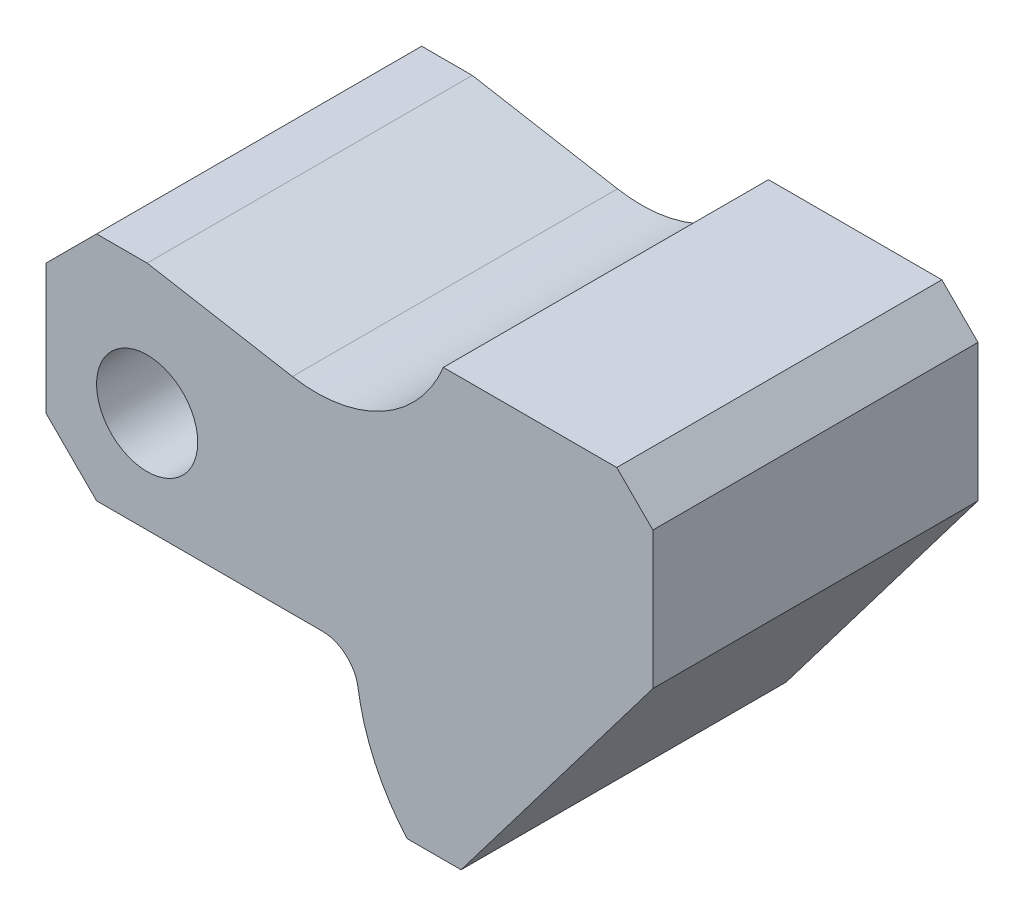
ISO-10303-21;
HEADER;
FILE_DESCRIPTION(('STEP AP214'),'2;1');
FILE_NAME('part.step','',(''),(''),'','','');
FILE_SCHEMA(('AUTOMOTIVE_DESIGN { 1 0 10303 214 1 1 1 1 }'));
ENDSEC;
DATA;
#1=APPLICATION_CONTEXT('core data for automotive mechanical design processes');
#2=APPLICATION_PROTOCOL_DEFINITION('international standard','automotive_design',2000,#1);
#3=PRODUCT_CONTEXT('',#1,'mechanical');
#4=PRODUCT('Part','Part','',(#3));
#5=PRODUCT_RELATED_PRODUCT_CATEGORY('part','',(#4));
#6=PRODUCT_DEFINITION_FORMATION('','',#4);
#7=PRODUCT_DEFINITION_CONTEXT('part definition',#1,'design');
#8=PRODUCT_DEFINITION('design','',#6,#7);
#9=PRODUCT_DEFINITION_SHAPE('','',#8);
#10=(LENGTH_UNIT() NAMED_UNIT(*) SI_UNIT(.MILLI.,.METRE.));
#11=(NAMED_UNIT(*) PLANE_ANGLE_UNIT() SI_UNIT($,.RADIAN.));
#12=(NAMED_UNIT(*) SI_UNIT($,.STERADIAN.) SOLID_ANGLE_UNIT());
#13=UNCERTAINTY_MEASURE_WITH_UNIT(LENGTH_MEASURE(1.E-05),#10,'distance_accuracy_value','');
#14=(GEOMETRIC_REPRESENTATION_CONTEXT(3) GLOBAL_UNCERTAINTY_ASSIGNED_CONTEXT((#13)) GLOBAL_UNIT_ASSIGNED_CONTEXT((#10,
#11,#12)) REPRESENTATION_CONTEXT('',''));
#15=CARTESIAN_POINT('',(0.,0.,0.));
#16=DIRECTION('',(0.,0.,1.));
#17=DIRECTION('',(1.,0.,0.));
#18=AXIS2_PLACEMENT_3D('',#15,#16,#17);
#19=CARTESIAN_POINT('',(61.0250562805475,-46.2889962459451,45.));
#20=DIRECTION('',(0.796728196361411,-0.60433780381728,0.));
#21=DIRECTION('',(0.60433780381728,0.796728196361411,0.));
#22=AXIS2_PLACEMENT_3D('',#19,#20,#21);
#23=PLANE('',#22);
#24=DIRECTION('',(-0.60433780381728,-0.796728196361411,0.));
#25=VECTOR('',#24,1.);
#26=CARTESIAN_POINT('',(61.0250562805475,-46.2889962459451,0.));
#27=LINE('',#26,#25);
#28=CARTESIAN_POINT('',(84.,-16.,0.));
#29=VERTEX_POINT('',#28);
#30=CARTESIAN_POINT('',(57.4516448266757,-51.,0.));
#31=VERTEX_POINT('',#30);
#32=EDGE_CURVE('E175',#29,#31,#27,.T.);
#33=ORIENTED_EDGE('',*,*,#32,.F.);
#34=DIRECTION('',(0.,0.,-1.));
#35=VECTOR('',#34,1.);
#36=CARTESIAN_POINT('',(84.,-16.,45.));
#37=LINE('',#36,#35);
#38=CARTESIAN_POINT('',(84.,-16.,45.));
#39=VERTEX_POINT('',#38);
#40=EDGE_CURVE('E161',#39,#29,#37,.T.);
#41=ORIENTED_EDGE('',*,*,#40,.F.);
#42=DIRECTION('',(-0.60433780381728,-0.796728196361411,0.));
#43=VECTOR('',#42,1.);
#44=CARTESIAN_POINT('',(61.0250562805475,-46.2889962459451,45.));
#45=LINE('',#44,#43);
#46=CARTESIAN_POINT('',(57.4516448266757,-51.,45.));
#47=VERTEX_POINT('',#46);
#48=EDGE_CURVE('E170',#39,#47,#45,.T.);
#49=ORIENTED_EDGE('',*,*,#48,.T.);
#50=DIRECTION('',(0.,0.,-1.));
#51=VECTOR('',#50,1.);
#52=CARTESIAN_POINT('',(57.4516448266757,-51.,45.));
#53=LINE('',#52,#51);
#54=EDGE_CURVE('E218',#47,#31,#53,.T.);
#55=ORIENTED_EDGE('',*,*,#54,.T.);
#56=EDGE_LOOP('',(#33,#41,#49,#55));
#57=FACE_BOUND('',#56,.T.);
#58=ADVANCED_FACE('F55',(#57),#23,.T.);
#59=CARTESIAN_POINT('',(84.,0.,45.));
#60=DIRECTION('',(1.,0.,0.));
#61=DIRECTION('',(0.,1.,0.));
#62=AXIS2_PLACEMENT_3D('',#59,#60,#61);
#63=PLANE('',#62);
#64=DIRECTION('',(0.,-1.,0.));
#65=VECTOR('',#64,1.);
#66=CARTESIAN_POINT('',(84.,0.,0.));
#67=LINE('',#66,#65);
#68=CARTESIAN_POINT('',(84.,3.,0.));
#69=VERTEX_POINT('',#68);
#70=EDGE_CURVE('E225',#69,#29,#67,.T.);
#71=ORIENTED_EDGE('',*,*,#70,.F.);
#72=DIRECTION('',(0.,0.,1.));
#73=VECTOR('',#72,1.);
#74=CARTESIAN_POINT('',(84.,3.,45.));
#75=LINE('',#74,#73);
#76=CARTESIAN_POINT('',(84.,3.,45.));
#77=VERTEX_POINT('',#76);
#78=EDGE_CURVE('E164',#69,#77,#75,.T.);
#79=ORIENTED_EDGE('',*,*,#78,.T.);
#80=DIRECTION('',(0.,-1.,0.));
#81=VECTOR('',#80,1.);
#82=CARTESIAN_POINT('',(84.,0.,45.));
#83=LINE('',#82,#81);
#84=EDGE_CURVE('E157',#77,#39,#83,.T.);
#85=ORIENTED_EDGE('',*,*,#84,.T.);
#86=ORIENTED_EDGE('',*,*,#40,.T.);
#87=EDGE_LOOP('',(#71,#79,#85,#86));
#88=FACE_BOUND('',#87,.T.);
#89=ADVANCED_FACE('F160',(#88),#63,.T.);
#90=CARTESIAN_POINT('',(0.,8.,45.));
#91=DIRECTION('',(0.,1.,0.));
#92=DIRECTION('',(0.,0.,1.));
#93=AXIS2_PLACEMENT_3D('',#90,#91,#92);
#94=PLANE('',#93);
#95=DIRECTION('',(1.,0.,0.));
#96=VECTOR('',#95,1.);
#97=CARTESIAN_POINT('',(0.,8.,45.));
#98=LINE('',#97,#96);
#99=CARTESIAN_POINT('',(55.,8.,45.));
#100=VERTEX_POINT('',#99);
#101=CARTESIAN_POINT('',(79.,8.,45.));
#102=VERTEX_POINT('',#101);
#103=EDGE_CURVE('E169',#100,#102,#98,.T.);
#104=ORIENTED_EDGE('',*,*,#103,.T.);
#105=DIRECTION('',(0.,0.,-1.));
#106=VECTOR('',#105,1.);
#107=CARTESIAN_POINT('',(79.,8.,45.));
#108=LINE('',#107,#106);
#109=CARTESIAN_POINT('',(79.,8.,0.));
#110=VERTEX_POINT('',#109);
#111=EDGE_CURVE('E296',#102,#110,#108,.T.);
#112=ORIENTED_EDGE('',*,*,#111,.T.);
#113=DIRECTION('',(1.,0.,0.));
#114=VECTOR('',#113,1.);
#115=CARTESIAN_POINT('',(0.,8.,0.));
#116=LINE('',#115,#114);
#117=CARTESIAN_POINT('',(55.,8.,0.));
#118=VERTEX_POINT('',#117);
#119=EDGE_CURVE('E228',#118,#110,#116,.T.);
#120=ORIENTED_EDGE('',*,*,#119,.F.);
#121=DIRECTION('',(0.,0.,-1.));
#122=VECTOR('',#121,1.);
#123=CARTESIAN_POINT('',(55.,8.,45.));
#124=LINE('',#123,#122);
#125=EDGE_CURVE('E178',#100,#118,#124,.T.);
#126=ORIENTED_EDGE('',*,*,#125,.F.);
#127=EDGE_LOOP('',(#104,#112,#120,#126));
#128=FACE_BOUND('',#127,.T.);
#129=ADVANCED_FACE('F343',(#128),#94,.T.);
#130=CARTESIAN_POINT('',(37.4033577276849,15.1664622192663,45.));
#131=DIRECTION('',(0.,0.,-1.));
#132=DIRECTION('',(-1.,0.,0.));
#133=AXIS2_PLACEMENT_3D('',#130,#131,#132);
#134=CYLINDRICAL_SURFACE('',#133,19.);
#135=CARTESIAN_POINT('',(37.4033577276849,15.1664622192663,0.));
#136=DIRECTION('',(0.,0.,1.));
#137=DIRECTION('',(1.,0.,0.));
#138=AXIS2_PLACEMENT_3D('',#135,#136,#137);
#139=CIRCLE('',#138,19.);
#140=CARTESIAN_POINT('',(34.1040423520132,-3.54488508796561,0.));
#141=VERTEX_POINT('',#140);
#142=EDGE_CURVE('E232',#141,#118,#139,.T.);
#143=ORIENTED_EDGE('',*,*,#142,.F.);
#144=DIRECTION('',(0.,0.,-1.));
#145=VECTOR('',#144,1.);
#146=CARTESIAN_POINT('',(34.1040423520132,-3.54488508796561,45.));
#147=LINE('',#146,#145);
#148=CARTESIAN_POINT('',(34.1040423520132,-3.54488508796561,45.));
#149=VERTEX_POINT('',#148);
#150=EDGE_CURVE('E266',#149,#141,#147,.T.);
#151=ORIENTED_EDGE('',*,*,#150,.F.);
#152=CARTESIAN_POINT('',(37.4033577276849,15.1664622192663,45.));
#153=DIRECTION('',(0.,0.,1.));
#154=DIRECTION('',(1.,0.,0.));
#155=AXIS2_PLACEMENT_3D('',#152,#153,#154);
#156=CIRCLE('',#155,19.);
#157=EDGE_CURVE('E195',#149,#100,#156,.T.);
#158=ORIENTED_EDGE('',*,*,#157,.T.);
#159=ORIENTED_EDGE('',*,*,#125,.T.);
#160=EDGE_LOOP('',(#143,#151,#158,#159));
#161=FACE_BOUND('',#160,.T.);
#162=ADVANCED_FACE('F376',(#161),#134,.F.);
#163=CARTESIAN_POINT('',(0.422151654498645,2.39414100327969,45.));
#164=DIRECTION('',(0.173648177666931,0.984807753012208,0.));
#165=DIRECTION('',(-0.984807753012208,0.173648177666931,0.));
#166=AXIS2_PLACEMENT_3D('',#163,#164,#165);
#167=PLANE('',#166);
#168=DIRECTION('',(0.984807753012208,-0.173648177666931,0.));
#169=VECTOR('',#168,1.);
#170=CARTESIAN_POINT('',(0.422151654498645,2.39414100327969,0.));
#171=LINE('',#170,#169);
#172=CARTESIAN_POINT('',(14.,0.,0.));
#173=VERTEX_POINT('',#172);
#174=EDGE_CURVE('E236',#173,#141,#171,.T.);
#175=ORIENTED_EDGE('',*,*,#174,.F.);
#176=DIRECTION('',(0.,0.,-1.));
#177=VECTOR('',#176,1.);
#178=CARTESIAN_POINT('',(14.,0.,45.));
#179=LINE('',#178,#177);
#180=CARTESIAN_POINT('',(14.,0.,45.));
#181=VERTEX_POINT('',#180);
#182=EDGE_CURVE('E262',#181,#173,#179,.T.);
#183=ORIENTED_EDGE('',*,*,#182,.F.);
#184=DIRECTION('',(0.984807753012208,-0.173648177666931,0.));
#185=VECTOR('',#184,1.);
#186=CARTESIAN_POINT('',(0.422151654498645,2.39414100327969,45.));
#187=LINE('',#186,#185);
#188=EDGE_CURVE('E199',#181,#149,#187,.T.);
#189=ORIENTED_EDGE('',*,*,#188,.T.);
#190=ORIENTED_EDGE('',*,*,#150,.T.);
#191=EDGE_LOOP('',(#175,#183,#189,#190));
#192=FACE_BOUND('',#191,.T.);
#193=ADVANCED_FACE('F382',(#192),#167,.T.);
#194=CARTESIAN_POINT('',(0.,0.,45.));
#195=DIRECTION('',(0.,1.,0.));
#196=DIRECTION('',(0.,0.,1.));
#197=AXIS2_PLACEMENT_3D('',#194,#195,#196);
#198=PLANE('',#197);
#199=DIRECTION('',(1.,0.,0.));
#200=VECTOR('',#199,1.);
#201=CARTESIAN_POINT('',(0.,0.,0.));
#202=LINE('',#201,#200);
#203=CARTESIAN_POINT('',(7.00000000000003,0.,0.));
#204=VERTEX_POINT('',#203);
#205=EDGE_CURVE('E240',#204,#173,#202,.T.);
#206=ORIENTED_EDGE('',*,*,#205,.F.);
#207=DIRECTION('',(0.,0.,1.));
#208=VECTOR('',#207,1.);
#209=CARTESIAN_POINT('',(7.00000000000003,0.,45.));
#210=LINE('',#209,#208);
#211=CARTESIAN_POINT('',(7.00000000000003,0.,45.));
#212=VERTEX_POINT('',#211);
#213=EDGE_CURVE('E277',#204,#212,#210,.T.);
#214=ORIENTED_EDGE('',*,*,#213,.T.);
#215=DIRECTION('',(1.,0.,0.));
#216=VECTOR('',#215,1.);
#217=CARTESIAN_POINT('',(0.,0.,45.));
#218=LINE('',#217,#216);
#219=EDGE_CURVE('E203',#212,#181,#218,.T.);
#220=ORIENTED_EDGE('',*,*,#219,.T.);
#221=ORIENTED_EDGE('',*,*,#182,.T.);
#222=EDGE_LOOP('',(#206,#214,#220,#221));
#223=FACE_BOUND('',#222,.T.);
#224=ADVANCED_FACE('F385',(#223),#198,.T.);
#225=CARTESIAN_POINT('',(0.,0.,45.));
#226=DIRECTION('',(1.,0.,0.));
#227=DIRECTION('',(0.,0.,-1.));
#228=AXIS2_PLACEMENT_3D('',#225,#226,#227);
#229=PLANE('',#228);
#230=DIRECTION('',(0.,-1.,0.));
#231=VECTOR('',#230,1.);
#232=CARTESIAN_POINT('',(0.,0.,0.));
#233=LINE('',#232,#231);
#234=CARTESIAN_POINT('',(0.,-7.,0.));
#235=VERTEX_POINT('',#234);
#236=CARTESIAN_POINT('',(0.,-25.,0.));
#237=VERTEX_POINT('',#236);
#238=EDGE_CURVE('E243',#235,#237,#233,.T.);
#239=ORIENTED_EDGE('',*,*,#238,.T.);
#240=DIRECTION('',(0.,0.,1.));
#241=VECTOR('',#240,1.);
#242=CARTESIAN_POINT('',(0.,-25.,45.));
#243=LINE('',#242,#241);
#244=CARTESIAN_POINT('',(0.,-25.,45.));
#245=VERTEX_POINT('',#244);
#246=EDGE_CURVE('E290',#237,#245,#243,.T.);
#247=ORIENTED_EDGE('',*,*,#246,.T.);
#248=DIRECTION('',(0.,-1.,0.));
#249=VECTOR('',#248,1.);
#250=CARTESIAN_POINT('',(0.,0.,45.));
#251=LINE('',#250,#249);
#252=CARTESIAN_POINT('',(0.,-7.,45.));
#253=VERTEX_POINT('',#252);
#254=EDGE_CURVE('E206',#253,#245,#251,.T.);
#255=ORIENTED_EDGE('',*,*,#254,.F.);
#256=DIRECTION('',(0.,0.,-1.));
#257=VECTOR('',#256,1.);
#258=CARTESIAN_POINT('',(0.,-7.,0.));
#259=LINE('',#258,#257);
#260=EDGE_CURVE('E177',#253,#235,#259,.T.);
#261=ORIENTED_EDGE('',*,*,#260,.T.);
#262=EDGE_LOOP('',(#239,#247,#255,#261));
#263=FACE_BOUND('',#262,.T.);
#264=ADVANCED_FACE('F392',(#263),#229,.F.);
#265=CARTESIAN_POINT('',(0.,-32.,45.));
#266=DIRECTION('',(0.,1.,0.));
#267=DIRECTION('',(-1.,0.,0.));
#268=AXIS2_PLACEMENT_3D('',#265,#266,#267);
#269=PLANE('',#268);
#270=DIRECTION('',(1.,0.,0.));
#271=VECTOR('',#270,1.);
#272=CARTESIAN_POINT('',(0.,-32.,0.));
#273=LINE('',#272,#271);
#274=CARTESIAN_POINT('',(6.99999999999998,-32.,0.));
#275=VERTEX_POINT('',#274);
#276=CARTESIAN_POINT('',(38.2332651848721,-32.,0.));
#277=VERTEX_POINT('',#276);
#278=EDGE_CURVE('E247',#275,#277,#273,.T.);
#279=ORIENTED_EDGE('',*,*,#278,.T.);
#280=DIRECTION('',(0.,0.,1.));
#281=VECTOR('',#280,1.);
#282=CARTESIAN_POINT('',(38.2332651848721,-32.,45.));
#283=LINE('',#282,#281);
#284=CARTESIAN_POINT('',(38.2332651848721,-32.,45.));
#285=VERTEX_POINT('',#284);
#286=EDGE_CURVE('E77',#277,#285,#283,.T.);
#287=ORIENTED_EDGE('',*,*,#286,.T.);
#288=DIRECTION('',(1.,0.,0.));
#289=VECTOR('',#288,1.);
#290=CARTESIAN_POINT('',(0.,-32.,45.));
#291=LINE('',#290,#289);
#292=CARTESIAN_POINT('',(6.99999999999998,-32.,45.));
#293=VERTEX_POINT('',#292);
#294=EDGE_CURVE('E210',#293,#285,#291,.T.);
#295=ORIENTED_EDGE('',*,*,#294,.F.);
#296=DIRECTION('',(0.,0.,-1.));
#297=VECTOR('',#296,1.);
#298=CARTESIAN_POINT('',(6.99999999999998,-32.,45.));
#299=LINE('',#298,#297);
#300=EDGE_CURVE('E283',#293,#275,#299,.T.);
#301=ORIENTED_EDGE('',*,*,#300,.T.);
#302=EDGE_LOOP('',(#279,#287,#295,#301));
#303=FACE_BOUND('',#302,.T.);
#304=ADVANCED_FACE('F396',(#303),#269,.F.);
#305=CARTESIAN_POINT('',(71.8636090636232,-32.,45.));
#306=DIRECTION('',(0.,0.,-1.));
#307=DIRECTION('',(-1.,0.,0.));
#308=AXIS2_PLACEMENT_3D('',#305,#306,#307);
#309=CYLINDRICAL_SURFACE('',#308,29.0000004323979);
#310=CARTESIAN_POINT('',(71.8636090636232,-32.,45.));
#311=DIRECTION('',(0.,0.,1.));
#312=DIRECTION('',(1.,0.,0.));
#313=AXIS2_PLACEMENT_3D('',#310,#311,#312);
#314=CIRCLE('',#313,29.0000004323979);
#315=CARTESIAN_POINT('',(43.1789039276742,-36.2647058917041,45.));
#316=VERTEX_POINT('',#315);
#317=CARTESIAN_POINT('',(49.9547061910676,-51.,45.));
#318=VERTEX_POINT('',#317);
#319=EDGE_CURVE('E213',#316,#318,#314,.T.);
#320=ORIENTED_EDGE('',*,*,#319,.F.);
#321=DIRECTION('',(0.,0.,-1.));
#322=VECTOR('',#321,1.);
#323=CARTESIAN_POINT('',(43.1789039276742,-36.2647058917041,45.));
#324=LINE('',#323,#322);
#325=CARTESIAN_POINT('',(43.1789039276742,-36.2647058917041,0.));
#326=VERTEX_POINT('',#325);
#327=EDGE_CURVE('E308',#316,#326,#324,.T.);
#328=ORIENTED_EDGE('',*,*,#327,.T.);
#329=CARTESIAN_POINT('',(71.8636090636232,-32.,0.));
#330=DIRECTION('',(0.,0.,1.));
#331=DIRECTION('',(1.,0.,0.));
#332=AXIS2_PLACEMENT_3D('',#329,#330,#331);
#333=CIRCLE('',#332,29.0000004323979);
#334=CARTESIAN_POINT('',(49.9547061910676,-51.,0.));
#335=VERTEX_POINT('',#334);
#336=EDGE_CURVE('E250',#326,#335,#333,.T.);
#337=ORIENTED_EDGE('',*,*,#336,.T.);
#338=DIRECTION('',(0.,0.,-1.));
#339=VECTOR('',#338,1.);
#340=CARTESIAN_POINT('',(49.9547061910676,-51.,45.));
#341=LINE('',#340,#339);
#342=EDGE_CURVE('E258',#318,#335,#341,.T.);
#343=ORIENTED_EDGE('',*,*,#342,.F.);
#344=EDGE_LOOP('',(#320,#328,#337,#343));
#345=FACE_BOUND('',#344,.T.);
#346=ADVANCED_FACE('F317',(#345),#309,.T.);
#347=CARTESIAN_POINT('',(14.,-18.,45.));
#348=DIRECTION('',(0.,0.,-1.));
#349=DIRECTION('',(-1.,0.,0.));
#350=AXIS2_PLACEMENT_3D('',#347,#348,#349);
#351=CYLINDRICAL_SURFACE('',#350,7.);
#352=CARTESIAN_POINT('',(14.,-18.,45.));
#353=DIRECTION('',(0.,0.,1.));
#354=DIRECTION('',(1.,0.,0.));
#355=AXIS2_PLACEMENT_3D('',#352,#353,#354);
#356=CIRCLE('',#355,7.);
#357=CARTESIAN_POINT('',(21.,-18.,45.));
#358=VERTEX_POINT('',#357);
#359=EDGE_CURVE('E185',#358,#358,#356,.T.);
#360=ORIENTED_EDGE('',*,*,#359,.T.);
#361=EDGE_LOOP('',(#360));
#362=FACE_BOUND('',#361,.T.);
#363=CARTESIAN_POINT('',(14.,-18.,0.));
#364=DIRECTION('',(0.,0.,1.));
#365=DIRECTION('',(1.,0.,0.));
#366=AXIS2_PLACEMENT_3D('',#363,#364,#365);
#367=CIRCLE('',#366,7.);
#368=CARTESIAN_POINT('',(21.,-18.,0.));
#369=VERTEX_POINT('',#368);
#370=EDGE_CURVE('E219',#369,#369,#367,.T.);
#371=ORIENTED_EDGE('',*,*,#370,.F.);
#372=EDGE_LOOP('',(#371));
#373=FACE_BOUND('',#372,.T.);
#374=ADVANCED_FACE('F326',(#362,#373),#351,.F.);
#375=CARTESIAN_POINT('',(0.,-51.,45.));
#376=DIRECTION('',(0.,1.,0.));
#377=DIRECTION('',(0.,0.,1.));
#378=AXIS2_PLACEMENT_3D('',#375,#376,#377);
#379=PLANE('',#378);
#380=DIRECTION('',(1.,0.,0.));
#381=VECTOR('',#380,1.);
#382=CARTESIAN_POINT('',(0.,-51.,0.));
#383=LINE('',#382,#381);
#384=EDGE_CURVE('E189',#335,#31,#383,.T.);
#385=ORIENTED_EDGE('',*,*,#384,.T.);
#386=ORIENTED_EDGE('',*,*,#54,.F.);
#387=DIRECTION('',(1.,0.,0.));
#388=VECTOR('',#387,1.);
#389=CARTESIAN_POINT('',(0.,-51.,45.));
#390=LINE('',#389,#388);
#391=EDGE_CURVE('E182',#318,#47,#390,.T.);
#392=ORIENTED_EDGE('',*,*,#391,.F.);
#393=ORIENTED_EDGE('',*,*,#342,.T.);
#394=EDGE_LOOP('',(#385,#386,#392,#393));
#395=FACE_BOUND('',#394,.T.);
#396=ADVANCED_FACE('F324',(#395),#379,.F.);
#397=CARTESIAN_POINT('',(0.,0.,45.));
#398=DIRECTION('',(0.,0.,1.));
#399=DIRECTION('',(1.,0.,0.));
#400=AXIS2_PLACEMENT_3D('',#397,#398,#399);
#401=PLANE('',#400);
#402=ORIENTED_EDGE('',*,*,#359,.F.);
#403=EDGE_LOOP('',(#402));
#404=FACE_BOUND('',#403,.T.);
#405=ORIENTED_EDGE('',*,*,#84,.F.);
#406=DIRECTION('',(0.707106781186549,-0.707106781186546,0.));
#407=VECTOR('',#406,1.);
#408=CARTESIAN_POINT('',(43.4999999999999,43.5,45.));
#409=LINE('',#408,#407);
#410=EDGE_CURVE('E305',#77,#102,#409,.F.);
#411=ORIENTED_EDGE('',*,*,#410,.T.);
#412=ORIENTED_EDGE('',*,*,#103,.F.);
#413=ORIENTED_EDGE('',*,*,#157,.F.);
#414=ORIENTED_EDGE('',*,*,#188,.F.);
#415=ORIENTED_EDGE('',*,*,#219,.F.);
#416=DIRECTION('',(-0.707106781186549,-0.707106781186546,0.));
#417=VECTOR('',#416,1.);
#418=CARTESIAN_POINT('',(3.5,-3.50000000000002,45.));
#419=LINE('',#418,#417);
#420=EDGE_CURVE('E280',#212,#253,#419,.T.);
#421=ORIENTED_EDGE('',*,*,#420,.T.);
#422=ORIENTED_EDGE('',*,*,#254,.T.);
#423=DIRECTION('',(-0.707106781186546,0.707106781186549,0.));
#424=VECTOR('',#423,1.);
#425=CARTESIAN_POINT('',(-12.5,-12.4999999999999,45.));
#426=LINE('',#425,#424);
#427=EDGE_CURVE('E293',#245,#293,#426,.F.);
#428=ORIENTED_EDGE('',*,*,#427,.T.);
#429=ORIENTED_EDGE('',*,*,#294,.T.);
#430=CARTESIAN_POINT('',(38.2332651848721,-37.,45.));
#431=DIRECTION('',(0.,0.,1.));
#432=DIRECTION('',(1.,0.,0.));
#433=AXIS2_PLACEMENT_3D('',#430,#431,#432);
#434=CIRCLE('',#433,5.);
#435=EDGE_CURVE('E11',#285,#316,#434,.F.);
#436=ORIENTED_EDGE('',*,*,#435,.T.);
#437=ORIENTED_EDGE('',*,*,#319,.T.);
#438=ORIENTED_EDGE('',*,*,#391,.T.);
#439=ORIENTED_EDGE('',*,*,#48,.F.);
#440=EDGE_LOOP('',(#405,#411,#412,#413,#414,#415,#421,#422,#428,#429,#436,#437,#438,#439));
#441=FACE_BOUND('',#440,.T.);
#442=ADVANCED_FACE('F180',(#404,#441),#401,.T.);
#443=CARTESIAN_POINT('',(0.,0.,0.));
#444=DIRECTION('',(0.,0.,1.));
#445=DIRECTION('',(1.,0.,0.));
#446=AXIS2_PLACEMENT_3D('',#443,#444,#445);
#447=PLANE('',#446);
#448=ORIENTED_EDGE('',*,*,#370,.T.);
#449=EDGE_LOOP('',(#448));
#450=FACE_BOUND('',#449,.T.);
#451=ORIENTED_EDGE('',*,*,#119,.T.);
#452=DIRECTION('',(-0.707106781186549,0.707106781186546,0.));
#453=VECTOR('',#452,1.);
#454=CARTESIAN_POINT('',(79.,8.,0.));
#455=LINE('',#454,#453);
#456=EDGE_CURVE('E300',#110,#69,#455,.F.);
#457=ORIENTED_EDGE('',*,*,#456,.T.);
#458=ORIENTED_EDGE('',*,*,#70,.T.);
#459=ORIENTED_EDGE('',*,*,#32,.T.);
#460=ORIENTED_EDGE('',*,*,#384,.F.);
#461=ORIENTED_EDGE('',*,*,#336,.F.);
#462=CARTESIAN_POINT('',(38.2332651848721,-37.,0.));
#463=DIRECTION('',(0.,0.,1.));
#464=DIRECTION('',(1.,0.,0.));
#465=AXIS2_PLACEMENT_3D('',#462,#463,#464);
#466=CIRCLE('',#465,5.);
#467=EDGE_CURVE('E64',#326,#277,#466,.T.);
#468=ORIENTED_EDGE('',*,*,#467,.T.);
#469=ORIENTED_EDGE('',*,*,#278,.F.);
#470=DIRECTION('',(0.707106781186546,-0.707106781186549,0.));
#471=VECTOR('',#470,1.);
#472=CARTESIAN_POINT('',(6.99999999999998,-32.,0.));
#473=LINE('',#472,#471);
#474=EDGE_CURVE('E287',#275,#237,#473,.F.);
#475=ORIENTED_EDGE('',*,*,#474,.T.);
#476=ORIENTED_EDGE('',*,*,#238,.F.);
#477=DIRECTION('',(0.707106781186549,0.707106781186546,0.));
#478=VECTOR('',#477,1.);
#479=CARTESIAN_POINT('',(0.,-7.,0.));
#480=LINE('',#479,#478);
#481=EDGE_CURVE('E274',#235,#204,#480,.T.);
#482=ORIENTED_EDGE('',*,*,#481,.T.);
#483=ORIENTED_EDGE('',*,*,#205,.T.);
#484=ORIENTED_EDGE('',*,*,#174,.T.);
#485=ORIENTED_EDGE('',*,*,#142,.T.);
#486=EDGE_LOOP('',(#451,#457,#458,#459,#460,#461,#468,#469,#475,#476,#482,#483,#484,#485));
#487=FACE_BOUND('',#486,.T.);
#488=ADVANCED_FACE('F322',(#450,#487),#447,.F.);
#489=CARTESIAN_POINT('',(0.,-7.,45.));
#490=DIRECTION('',(-0.707106781186546,0.707106781186549,0.));
#491=DIRECTION('',(0.,0.,1.));
#492=AXIS2_PLACEMENT_3D('',#489,#490,#491);
#493=PLANE('',#492);
#494=ORIENTED_EDGE('',*,*,#420,.F.);
#495=ORIENTED_EDGE('',*,*,#213,.F.);
#496=ORIENTED_EDGE('',*,*,#481,.F.);
#497=ORIENTED_EDGE('',*,*,#260,.F.);
#498=EDGE_LOOP('',(#494,#495,#496,#497));
#499=FACE_BOUND('',#498,.T.);
#500=ADVANCED_FACE('F348',(#499),#493,.T.);
#501=CARTESIAN_POINT('',(6.99999999999998,-32.,45.));
#502=DIRECTION('',(0.707106781186549,0.707106781186546,0.));
#503=DIRECTION('',(0.,0.,-1.));
#504=AXIS2_PLACEMENT_3D('',#501,#502,#503);
#505=PLANE('',#504);
#506=ORIENTED_EDGE('',*,*,#427,.F.);
#507=ORIENTED_EDGE('',*,*,#246,.F.);
#508=ORIENTED_EDGE('',*,*,#474,.F.);
#509=ORIENTED_EDGE('',*,*,#300,.F.);
#510=EDGE_LOOP('',(#506,#507,#508,#509));
#511=FACE_BOUND('',#510,.T.);
#512=ADVANCED_FACE('F354',(#511),#505,.F.);
#513=CARTESIAN_POINT('',(79.,8.,45.));
#514=DIRECTION('',(-0.707106781186546,-0.707106781186549,0.));
#515=DIRECTION('',(0.,0.,-1.));
#516=AXIS2_PLACEMENT_3D('',#513,#514,#515);
#517=PLANE('',#516);
#518=ORIENTED_EDGE('',*,*,#410,.F.);
#519=ORIENTED_EDGE('',*,*,#78,.F.);
#520=ORIENTED_EDGE('',*,*,#456,.F.);
#521=ORIENTED_EDGE('',*,*,#111,.F.);
#522=EDGE_LOOP('',(#518,#519,#520,#521));
#523=FACE_BOUND('',#522,.T.);
#524=ADVANCED_FACE('F360',(#523),#517,.F.);
#525=CARTESIAN_POINT('',(38.2332651848721,-37.,45.));
#526=DIRECTION('',(0.,0.,-1.));
#527=DIRECTION('',(-1.,0.,0.));
#528=AXIS2_PLACEMENT_3D('',#525,#526,#527);
#529=CYLINDRICAL_SURFACE('',#528,5.);
#530=ORIENTED_EDGE('',*,*,#435,.F.);
#531=ORIENTED_EDGE('',*,*,#286,.F.);
#532=ORIENTED_EDGE('',*,*,#467,.F.);
#533=ORIENTED_EDGE('',*,*,#327,.F.);
#534=EDGE_LOOP('',(#530,#531,#532,#533));
#535=FACE_BOUND('',#534,.T.);
#536=ADVANCED_FACE('F57',(#535),#529,.F.);
#537=CLOSED_SHELL('',(#58,#89,#129,#162,#193,#224,#264,#304,#346,#374,#396,#442,#488,#500,#512,
#524,#536));
#538=MANIFOLD_SOLID_BREP('B2',#537);
#539=ADVANCED_BREP_SHAPE_REPRESENTATION('',(#18,#538),#14);
#540=SHAPE_DEFINITION_REPRESENTATION(#9,#539);
ENDSEC;
END-ISO-10303-21;
